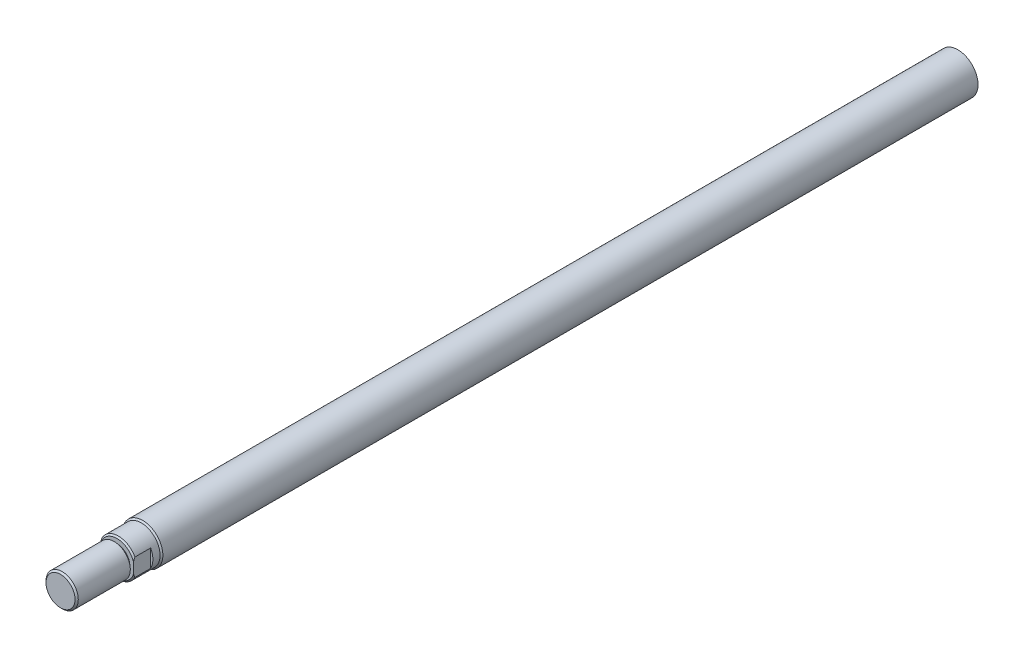
ISO-10303-21;
HEADER;
FILE_DESCRIPTION(('STEP AP214'),'2;1');
FILE_NAME('part.step','',(''),(''),'','','');
FILE_SCHEMA(('AUTOMOTIVE_DESIGN { 1 0 10303 214 1 1 1 1 }'));
ENDSEC;
DATA;
#1=APPLICATION_CONTEXT('core data for automotive mechanical design processes');
#2=APPLICATION_PROTOCOL_DEFINITION('international standard','automotive_design',2000,#1);
#3=PRODUCT_CONTEXT('',#1,'mechanical');
#4=PRODUCT('Part','Part','',(#3));
#5=PRODUCT_RELATED_PRODUCT_CATEGORY('part','',(#4));
#6=PRODUCT_DEFINITION_FORMATION('','',#4);
#7=PRODUCT_DEFINITION_CONTEXT('part definition',#1,'design');
#8=PRODUCT_DEFINITION('design','',#6,#7);
#9=PRODUCT_DEFINITION_SHAPE('','',#8);
#10=(LENGTH_UNIT() NAMED_UNIT(*) SI_UNIT(.MILLI.,.METRE.));
#11=(NAMED_UNIT(*) PLANE_ANGLE_UNIT() SI_UNIT($,.RADIAN.));
#12=(NAMED_UNIT(*) SI_UNIT($,.STERADIAN.) SOLID_ANGLE_UNIT());
#13=UNCERTAINTY_MEASURE_WITH_UNIT(LENGTH_MEASURE(1.E-05),#10,'distance_accuracy_value','');
#14=(GEOMETRIC_REPRESENTATION_CONTEXT(3) GLOBAL_UNCERTAINTY_ASSIGNED_CONTEXT((#13)) GLOBAL_UNIT_ASSIGNED_CONTEXT((#10,
#11,#12)) REPRESENTATION_CONTEXT('',''));
#15=CARTESIAN_POINT('',(0.,0.,0.));
#16=DIRECTION('',(0.,0.,1.));
#17=DIRECTION('',(1.,0.,0.));
#18=AXIS2_PLACEMENT_3D('',#15,#16,#17);
#19=CARTESIAN_POINT('',(0.,0.,16.3));
#20=DIRECTION('',(0.,0.,-1.));
#21=DIRECTION('',(-1.,0.,0.));
#22=AXIS2_PLACEMENT_3D('',#19,#20,#21);
#23=CONICAL_SURFACE('',#22,9.3,0.785398163397424);
#24=CARTESIAN_POINT('',(8.2,9.66938646409968,12.9217889829788));
#25=CARTESIAN_POINT('',(8.2,9.42998896150562,13.1043279332616));
#26=CARTESIAN_POINT('',(8.2,9.18925082407671,13.2851381900016));
#27=CARTESIAN_POINT('',(8.2,8.70453793453939,13.6424973615461));
#28=CARTESIAN_POINT('',(8.2,8.46056234686755,13.819045141731));
#29=CARTESIAN_POINT('',(8.2,7.96682637123515,14.1684776338376));
#30=CARTESIAN_POINT('',(8.2,7.71703424980347,14.3413176647774));
#31=CARTESIAN_POINT('',(8.2,7.21312298565451,14.6805490713805));
#32=CARTESIAN_POINT('',(8.2,6.95900416670312,14.8469409265334));
#33=CARTESIAN_POINT('',(8.2,6.42947671292095,15.1820586520401));
#34=CARTESIAN_POINT('',(8.2,6.15373827159313,15.3502662187331));
#35=CARTESIAN_POINT('',(8.2,5.5955497655709,15.6753497914216));
#36=CARTESIAN_POINT('',(8.2,5.31309849781905,15.8322237455684));
#37=CARTESIAN_POINT('',(8.2,4.74150496026828,16.1309612876175));
#38=CARTESIAN_POINT('',(8.2,4.45238826629966,16.2728733853582));
#39=CARTESIAN_POINT('',(8.2,3.86585505569199,16.5381850488038));
#40=CARTESIAN_POINT('',(8.2,3.56844287804944,16.661594084989));
#41=CARTESIAN_POINT('',(8.2,2.97954379579467,16.8795289509335));
#42=CARTESIAN_POINT('',(8.2,2.68847508231651,16.9751697153472));
#43=CARTESIAN_POINT('',(8.2,2.09889536787144,17.1403661216476));
#44=CARTESIAN_POINT('',(8.2,1.80038456917459,17.2099224716657));
#45=CARTESIAN_POINT('',(8.2,1.20406994705388,17.3171442848573));
#46=CARTESIAN_POINT('',(8.2,0.906383754375931,17.3554508204848));
#47=CARTESIAN_POINT('',(8.2,0.308599361296273,17.3996051557993));
#48=CARTESIAN_POINT('',(8.2,0.00850153186887214,17.4054578555395));
#49=CARTESIAN_POINT('',(8.2,-0.591231458672635,17.3841925609234));
#50=CARTESIAN_POINT('',(8.2,-0.890863686490328,17.3569937801791));
#51=CARTESIAN_POINT('',(8.2,-1.48566988710752,17.2717083902375));
#52=CARTESIAN_POINT('',(8.2,-1.78084275774996,17.2136142694729));
#53=CARTESIAN_POINT('',(8.2,-2.37070208146198,17.0690785130305));
#54=CARTESIAN_POINT('',(8.2,-2.6652445195716,16.9820599526893));
#55=CARTESIAN_POINT('',(8.2,-3.24639509628077,16.784997584622));
#56=CARTESIAN_POINT('',(8.2,-3.53300320904219,16.6749537019239));
#57=CARTESIAN_POINT('',(8.2,-4.08868065838188,16.4405228141886));
#58=CARTESIAN_POINT('',(8.2,-4.35801459110504,16.3167550735313));
#59=CARTESIAN_POINT('',(8.2,-4.88997313404525,16.0554655313575));
#60=CARTESIAN_POINT('',(8.2,-5.15259562501031,15.9179394511683));
#61=CARTESIAN_POINT('',(8.2,-5.67231767943956,15.6316471213539));
#62=CARTESIAN_POINT('',(8.2,-5.92940450076075,15.482857896668));
#63=CARTESIAN_POINT('',(8.2,-6.43822276614362,15.1764944940382));
#64=CARTESIAN_POINT('',(8.2,-6.6899548129336,15.0189213121147));
#65=CARTESIAN_POINT('',(8.2,-7.17436730586817,14.7059930250791));
#66=CARTESIAN_POINT('',(8.2,-7.4073070417649,14.5510375668562));
#67=CARTESIAN_POINT('',(8.2,-7.86963798897344,14.2359070977222));
#68=CARTESIAN_POINT('',(8.2,-8.0990290138282,14.0757318139143));
#69=CARTESIAN_POINT('',(8.2,-8.55345168120029,13.7519530887754));
#70=CARTESIAN_POINT('',(8.2,-8.77850045964103,13.5883736281135));
#71=CARTESIAN_POINT('',(8.2,-9.22587729874031,13.2576201644036));
#72=CARTESIAN_POINT('',(8.2,-9.44820586823233,13.0904468502536));
#73=CARTESIAN_POINT('',(8.2,-9.66938646409968,12.9217889829788));
#74=B_SPLINE_CURVE_WITH_KNOTS('',3,(#24,#25,#26,#27,#28,#29,#30,#31,#32,#33,#34,#35,#36,#37,#38,
#39,#40,#41,#42,#43,#44,#45,#46,#47,#48,#49,#50,#51,#52,#53,#54,#55,#56,#57,#58,#59,#60,#61,#62,
#63,#64,#65,#66,#67,#68,#69,#70,#71,#72,#73),.UNSPECIFIED.,.F.,.F.,(4,2,2,2,2,2,2,2,2,2,2,2,2,2,
2,2,2,2,2,2,2,2,2,2,4),(0.,0.903171316395402,1.8065804530234,2.71777523283702,3.62890212521683,
4.59767089342737,5.56661461129223,6.53231336518104,7.49751614259833,8.41565568227574,
9.33377029478543,10.2325398946054,11.1311737897005,12.0320086041224,12.9330625382225,
13.8532907884204,14.7735220349885,15.6622806210588,16.5513164643122,17.4422173814234,
18.3330174832005,19.1722500620807,20.0115265873367,20.8461418080354,21.6805984450706),.UNSPECIFIED.);
#75=CARTESIAN_POINT('',(8.2,4.38748219369605,16.3));
#76=VERTEX_POINT('',#75);
#77=CARTESIAN_POINT('',(8.2,2.59229627936318,17.));
#78=VERTEX_POINT('',#77);
#79=EDGE_CURVE('E117',#76,#78,#74,.T.);
#80=ORIENTED_EDGE('',*,*,#79,.F.);
#81=CARTESIAN_POINT('',(0.,0.,16.3));
#82=DIRECTION('',(0.,0.,-1.));
#83=DIRECTION('',(-1.,0.,0.));
#84=AXIS2_PLACEMENT_3D('',#81,#82,#83);
#85=CIRCLE('',#84,9.3);
#86=CARTESIAN_POINT('',(-8.2,4.38748219369605,16.3));
#87=VERTEX_POINT('',#86);
#88=EDGE_CURVE('E104',#87,#76,#85,.T.);
#89=ORIENTED_EDGE('',*,*,#88,.F.);
#90=CARTESIAN_POINT('',(-8.2,-9.66938646409968,12.9217889829788));
#91=CARTESIAN_POINT('',(-8.2,-9.42998896150562,13.1043279332616));
#92=CARTESIAN_POINT('',(-8.2,-9.18925082407671,13.2851381900016));
#93=CARTESIAN_POINT('',(-8.2,-8.70453793453939,13.6424973615461));
#94=CARTESIAN_POINT('',(-8.2,-8.46056234686755,13.819045141731));
#95=CARTESIAN_POINT('',(-8.2,-7.96682637123515,14.1684776338376));
#96=CARTESIAN_POINT('',(-8.2,-7.71703424980347,14.3413176647774));
#97=CARTESIAN_POINT('',(-8.2,-7.21312298565451,14.6805490713805));
#98=CARTESIAN_POINT('',(-8.2,-6.95900416670312,14.8469409265334));
#99=CARTESIAN_POINT('',(-8.2,-6.42947671292095,15.1820586520401));
#100=CARTESIAN_POINT('',(-8.2,-6.15373827159313,15.3502662187331));
#101=CARTESIAN_POINT('',(-8.2,-5.5955497655709,15.6753497914216));
#102=CARTESIAN_POINT('',(-8.2,-5.31309849781905,15.8322237455684));
#103=CARTESIAN_POINT('',(-8.2,-4.74150496026828,16.1309612876175));
#104=CARTESIAN_POINT('',(-8.2,-4.45238826629966,16.2728733853582));
#105=CARTESIAN_POINT('',(-8.2,-3.86585505569199,16.5381850488038));
#106=CARTESIAN_POINT('',(-8.2,-3.56844287804944,16.661594084989));
#107=CARTESIAN_POINT('',(-8.2,-2.97954379579467,16.8795289509335));
#108=CARTESIAN_POINT('',(-8.2,-2.68847508231651,16.9751697153472));
#109=CARTESIAN_POINT('',(-8.2,-2.09889536787144,17.1403661216476));
#110=CARTESIAN_POINT('',(-8.2,-1.80038456917459,17.2099224716657));
#111=CARTESIAN_POINT('',(-8.2,-1.20406994705388,17.3171442848573));
#112=CARTESIAN_POINT('',(-8.2,-0.906383754375931,17.3554508204848));
#113=CARTESIAN_POINT('',(-8.2,-0.308599361296273,17.3996051557993));
#114=CARTESIAN_POINT('',(-8.2,-0.00850153186887214,17.4054578555395));
#115=CARTESIAN_POINT('',(-8.2,0.591231458672635,17.3841925609234));
#116=CARTESIAN_POINT('',(-8.2,0.890863686490328,17.3569937801791));
#117=CARTESIAN_POINT('',(-8.2,1.48566988710752,17.2717083902375));
#118=CARTESIAN_POINT('',(-8.2,1.78084275774996,17.2136142694729));
#119=CARTESIAN_POINT('',(-8.2,2.37070208146198,17.0690785130305));
#120=CARTESIAN_POINT('',(-8.2,2.6652445195716,16.9820599526893));
#121=CARTESIAN_POINT('',(-8.2,3.24639509628077,16.784997584622));
#122=CARTESIAN_POINT('',(-8.2,3.53300320904219,16.6749537019239));
#123=CARTESIAN_POINT('',(-8.2,4.08868065838188,16.4405228141886));
#124=CARTESIAN_POINT('',(-8.2,4.35801459110504,16.3167550735313));
#125=CARTESIAN_POINT('',(-8.2,4.88997313404525,16.0554655313575));
#126=CARTESIAN_POINT('',(-8.2,5.15259562501031,15.9179394511683));
#127=CARTESIAN_POINT('',(-8.2,5.67231767943956,15.6316471213539));
#128=CARTESIAN_POINT('',(-8.2,5.92940450076075,15.482857896668));
#129=CARTESIAN_POINT('',(-8.2,6.43822276614362,15.1764944940382));
#130=CARTESIAN_POINT('',(-8.2,6.6899548129336,15.0189213121147));
#131=CARTESIAN_POINT('',(-8.2,7.17436730586817,14.7059930250791));
#132=CARTESIAN_POINT('',(-8.2,7.4073070417649,14.5510375668562));
#133=CARTESIAN_POINT('',(-8.2,7.86963798897344,14.2359070977222));
#134=CARTESIAN_POINT('',(-8.2,8.0990290138282,14.0757318139143));
#135=CARTESIAN_POINT('',(-8.2,8.55345168120029,13.7519530887754));
#136=CARTESIAN_POINT('',(-8.2,8.77850045964103,13.5883736281135));
#137=CARTESIAN_POINT('',(-8.2,9.22587729874031,13.2576201644036));
#138=CARTESIAN_POINT('',(-8.2,9.44820586823233,13.0904468502536));
#139=CARTESIAN_POINT('',(-8.2,9.66938646409968,12.9217889829788));
#140=B_SPLINE_CURVE_WITH_KNOTS('',3,(#90,#91,#92,#93,#94,#95,#96,#97,#98,#99,#100,#101,#102,
#103,#104,#105,#106,#107,#108,#109,#110,#111,#112,#113,#114,#115,#116,#117,#118,#119,#120,#121,
#122,#123,#124,#125,#126,#127,#128,#129,#130,#131,#132,#133,#134,#135,#136,#137,#138,#139),
.UNSPECIFIED.,.F.,.F.,(4,2,2,2,2,2,2,2,2,2,2,2,2,2,2,2,2,2,2,2,2,2,2,2,4),(0.,0.903171316395402,
1.8065804530234,2.71777523283702,3.62890212521683,4.59767089342737,5.56661461129223,
6.53231336518104,7.49751614259833,8.41565568227574,9.33377029478543,10.2325398946054,
11.1311737897005,12.0320086041224,12.9330625382225,13.8532907884204,14.7735220349885,
15.6622806210588,16.5513164643122,17.4422173814234,18.3330174832005,19.1722500620807,
20.0115265873367,20.8461418080354,21.6805984450706),.UNSPECIFIED.);
#141=CARTESIAN_POINT('',(-8.2,2.59229627936318,17.));
#142=VERTEX_POINT('',#141);
#143=EDGE_CURVE('E139',#142,#87,#140,.T.);
#144=ORIENTED_EDGE('',*,*,#143,.F.);
#145=CARTESIAN_POINT('',(0.,0.,17.));
#146=DIRECTION('',(0.,0.,-1.));
#147=DIRECTION('',(-1.,0.,0.));
#148=AXIS2_PLACEMENT_3D('',#145,#146,#147);
#149=CIRCLE('',#148,8.6);
#150=EDGE_CURVE('E162',#142,#78,#149,.T.);
#151=ORIENTED_EDGE('',*,*,#150,.T.);
#152=EDGE_LOOP('',(#80,#89,#144,#151));
#153=FACE_BOUND('',#152,.T.);
#154=ADVANCED_FACE('F35',(#153),#23,.T.);
#155=CARTESIAN_POINT('',(0.,0.,45.));
#156=DIRECTION('',(0.,0.,1.));
#157=DIRECTION('',(1.,0.,0.));
#158=AXIS2_PLACEMENT_3D('',#155,#156,#157);
#159=PLANE('',#158);
#160=CARTESIAN_POINT('',(0.,0.,45.));
#161=DIRECTION('',(0.,0.,1.));
#162=DIRECTION('',(1.,0.,0.));
#163=AXIS2_PLACEMENT_3D('',#160,#161,#162);
#164=CIRCLE('',#163,7.20000000000003);
#165=CARTESIAN_POINT('',(7.20000000000003,0.,45.));
#166=VERTEX_POINT('',#165);
#167=EDGE_CURVE('E11',#166,#166,#164,.T.);
#168=ORIENTED_EDGE('',*,*,#167,.T.);
#169=EDGE_LOOP('',(#168));
#170=FACE_BOUND('',#169,.T.);
#171=ADVANCED_FACE('F186',(#170),#159,.T.);
#172=CARTESIAN_POINT('',(0.,0.,-400.));
#173=DIRECTION('',(0.,0.,-1.));
#174=DIRECTION('',(-1.,0.,0.));
#175=AXIS2_PLACEMENT_3D('',#172,#173,#174);
#176=CYLINDRICAL_SURFACE('',#175,8.);
#177=CARTESIAN_POINT('',(0.,0.,44.2));
#178=DIRECTION('',(0.,0.,1.));
#179=DIRECTION('',(1.,0.,0.));
#180=AXIS2_PLACEMENT_3D('',#177,#178,#179);
#181=CIRCLE('',#180,8.);
#182=CARTESIAN_POINT('',(8.,0.,44.2));
#183=VERTEX_POINT('',#182);
#184=EDGE_CURVE('E43',#183,#183,#181,.F.);
#185=ORIENTED_EDGE('',*,*,#184,.T.);
#186=EDGE_LOOP('',(#185));
#187=FACE_BOUND('',#186,.T.);
#188=CARTESIAN_POINT('',(0.,0.,18.4));
#189=DIRECTION('',(0.,0.,-1.));
#190=DIRECTION('',(-1.,0.,0.));
#191=AXIS2_PLACEMENT_3D('',#188,#189,#190);
#192=CIRCLE('',#191,8.);
#193=CARTESIAN_POINT('',(-8.,0.,18.4));
#194=VERTEX_POINT('',#193);
#195=EDGE_CURVE('E171',#194,#194,#192,.T.);
#196=ORIENTED_EDGE('',*,*,#195,.F.);
#197=EDGE_LOOP('',(#196));
#198=FACE_BOUND('',#197,.T.);
#199=ADVANCED_FACE('F176',(#187,#198),#176,.T.);
#200=CARTESIAN_POINT('',(0.,-8.,18.4));
#201=DIRECTION('',(0.,0.,-1.));
#202=DIRECTION('',(-1.,0.,0.));
#203=AXIS2_PLACEMENT_3D('',#200,#201,#202);
#204=PLANE('',#203);
#205=ORIENTED_EDGE('',*,*,#195,.T.);
#206=EDGE_LOOP('',(#205));
#207=FACE_BOUND('',#206,.T.);
#208=CARTESIAN_POINT('',(0.,0.,18.4));
#209=DIRECTION('',(0.,0.,-1.));
#210=DIRECTION('',(-1.,0.,0.));
#211=AXIS2_PLACEMENT_3D('',#208,#209,#210);
#212=CIRCLE('',#211,6.4);
#213=CARTESIAN_POINT('',(-6.4,0.,18.4));
#214=VERTEX_POINT('',#213);
#215=EDGE_CURVE('E168',#214,#214,#212,.T.);
#216=ORIENTED_EDGE('',*,*,#215,.F.);
#217=EDGE_LOOP('',(#216));
#218=FACE_BOUND('',#217,.T.);
#219=ADVANCED_FACE('F220',(#207,#218),#204,.T.);
#220=CARTESIAN_POINT('',(0.,0.,-400.));
#221=DIRECTION('',(0.,0.,-1.));
#222=DIRECTION('',(-1.,0.,0.));
#223=AXIS2_PLACEMENT_3D('',#220,#221,#222);
#224=CYLINDRICAL_SURFACE('',#223,6.4);
#225=ORIENTED_EDGE('',*,*,#215,.T.);
#226=EDGE_LOOP('',(#225));
#227=FACE_BOUND('',#226,.T.);
#228=CARTESIAN_POINT('',(0.,0.,17.));
#229=DIRECTION('',(0.,0.,-1.));
#230=DIRECTION('',(-1.,0.,0.));
#231=AXIS2_PLACEMENT_3D('',#228,#229,#230);
#232=CIRCLE('',#231,6.4);
#233=CARTESIAN_POINT('',(-6.4,0.,17.));
#234=VERTEX_POINT('',#233);
#235=EDGE_CURVE('E165',#234,#234,#232,.T.);
#236=ORIENTED_EDGE('',*,*,#235,.F.);
#237=EDGE_LOOP('',(#236));
#238=FACE_BOUND('',#237,.T.);
#239=ADVANCED_FACE('F200',(#227,#238),#224,.T.);
#240=CARTESIAN_POINT('',(0.,-6.4,17.));
#241=DIRECTION('',(0.,0.,1.));
#242=DIRECTION('',(1.,0.,0.));
#243=AXIS2_PLACEMENT_3D('',#240,#241,#242);
#244=PLANE('',#243);
#245=DIRECTION('',(0.,-1.,0.));
#246=VECTOR('',#245,1.);
#247=CARTESIAN_POINT('',(8.2,4.38748219369605,17.));
#248=LINE('',#247,#246);
#249=CARTESIAN_POINT('',(8.2,-2.59229627936318,17.));
#250=VERTEX_POINT('',#249);
#251=EDGE_CURVE('E91',#78,#250,#248,.T.);
#252=ORIENTED_EDGE('',*,*,#251,.F.);
#253=ORIENTED_EDGE('',*,*,#150,.F.);
#254=DIRECTION('',(0.,1.,0.));
#255=VECTOR('',#254,1.);
#256=CARTESIAN_POINT('',(-8.2,4.38748219369605,17.));
#257=LINE('',#256,#255);
#258=CARTESIAN_POINT('',(-8.2,-2.59229627936318,17.));
#259=VERTEX_POINT('',#258);
#260=EDGE_CURVE('E211',#259,#142,#257,.T.);
#261=ORIENTED_EDGE('',*,*,#260,.F.);
#262=EDGE_CURVE('E161',#250,#259,#149,.T.);
#263=ORIENTED_EDGE('',*,*,#262,.F.);
#264=EDGE_LOOP('',(#252,#253,#261,#263));
#265=FACE_BOUND('',#264,.T.);
#266=ORIENTED_EDGE('',*,*,#235,.T.);
#267=EDGE_LOOP('',(#266));
#268=FACE_BOUND('',#267,.T.);
#269=ADVANCED_FACE('F193',(#265,#268),#244,.T.);
#270=CARTESIAN_POINT('',(8.2,-4.38748219369605,16.3));
#271=VERTEX_POINT('',#270);
#272=EDGE_CURVE('E106',#250,#271,#74,.T.);
#273=ORIENTED_EDGE('',*,*,#272,.F.);
#274=ORIENTED_EDGE('',*,*,#262,.T.);
#275=CARTESIAN_POINT('',(-8.2,-4.38748219369605,16.3));
#276=VERTEX_POINT('',#275);
#277=EDGE_CURVE('E146',#276,#259,#140,.T.);
#278=ORIENTED_EDGE('',*,*,#277,.F.);
#279=EDGE_CURVE('E159',#271,#276,#85,.T.);
#280=ORIENTED_EDGE('',*,*,#279,.F.);
#281=EDGE_LOOP('',(#273,#274,#278,#280));
#282=FACE_BOUND('',#281,.T.);
#283=ADVANCED_FACE('F120',(#282),#23,.T.);
#284=CARTESIAN_POINT('',(0.,0.,-400.));
#285=DIRECTION('',(0.,0.,-1.));
#286=DIRECTION('',(-1.,0.,0.));
#287=AXIS2_PLACEMENT_3D('',#284,#285,#286);
#288=CYLINDRICAL_SURFACE('',#287,9.3);
#289=DIRECTION('',(0.,0.,1.));
#290=VECTOR('',#289,1.);
#291=CARTESIAN_POINT('',(8.2,4.38748219369605,8.5));
#292=LINE('',#291,#290);
#293=CARTESIAN_POINT('',(8.2,4.38748219369605,8.5));
#294=VERTEX_POINT('',#293);
#295=EDGE_CURVE('E95',#294,#76,#292,.T.);
#296=ORIENTED_EDGE('',*,*,#295,.F.);
#297=CARTESIAN_POINT('',(0.,0.,8.5));
#298=DIRECTION('',(0.,0.,1.));
#299=DIRECTION('',(1.,0.,0.));
#300=AXIS2_PLACEMENT_3D('',#297,#298,#299);
#301=CIRCLE('',#300,9.3);
#302=CARTESIAN_POINT('',(8.2,-4.38748219369605,8.50000000000001));
#303=VERTEX_POINT('',#302);
#304=EDGE_CURVE('E86',#303,#294,#301,.T.);
#305=ORIENTED_EDGE('',*,*,#304,.F.);
#306=DIRECTION('',(0.,0.,1.));
#307=VECTOR('',#306,1.);
#308=CARTESIAN_POINT('',(8.2,-4.38748219369605,8.5));
#309=LINE('',#308,#307);
#310=EDGE_CURVE('E97',#303,#271,#309,.T.);
#311=ORIENTED_EDGE('',*,*,#310,.T.);
#312=ORIENTED_EDGE('',*,*,#279,.T.);
#313=DIRECTION('',(0.,0.,1.));
#314=VECTOR('',#313,1.);
#315=CARTESIAN_POINT('',(-8.2,-4.38748219369605,8.5));
#316=LINE('',#315,#314);
#317=CARTESIAN_POINT('',(-8.2,-4.38748219369605,8.5));
#318=VERTEX_POINT('',#317);
#319=EDGE_CURVE('E148',#318,#276,#316,.T.);
#320=ORIENTED_EDGE('',*,*,#319,.F.);
#321=CARTESIAN_POINT('',(0.,0.,8.5));
#322=DIRECTION('',(0.,0.,1.));
#323=DIRECTION('',(1.,0.,0.));
#324=AXIS2_PLACEMENT_3D('',#321,#322,#323);
#325=CIRCLE('',#324,9.3);
#326=CARTESIAN_POINT('',(-8.2,4.38748219369605,8.50000000000001));
#327=VERTEX_POINT('',#326);
#328=EDGE_CURVE('E118',#327,#318,#325,.T.);
#329=ORIENTED_EDGE('',*,*,#328,.F.);
#330=DIRECTION('',(0.,0.,1.));
#331=VECTOR('',#330,1.);
#332=CARTESIAN_POINT('',(-8.2,4.38748219369605,8.5));
#333=LINE('',#332,#331);
#334=EDGE_CURVE('E147',#327,#87,#333,.T.);
#335=ORIENTED_EDGE('',*,*,#334,.T.);
#336=ORIENTED_EDGE('',*,*,#88,.T.);
#337=EDGE_LOOP('',(#296,#305,#311,#312,#320,#329,#335,#336));
#338=FACE_BOUND('',#337,.T.);
#339=CARTESIAN_POINT('',(0.,0.,4.95000000000001));
#340=DIRECTION('',(0.,0.,-1.));
#341=DIRECTION('',(-1.,0.,0.));
#342=AXIS2_PLACEMENT_3D('',#339,#340,#341);
#343=CIRCLE('',#342,9.3);
#344=CARTESIAN_POINT('',(-9.3,0.,4.95000000000001));
#345=VERTEX_POINT('',#344);
#346=EDGE_CURVE('E156',#345,#345,#343,.T.);
#347=ORIENTED_EDGE('',*,*,#346,.F.);
#348=EDGE_LOOP('',(#347));
#349=FACE_BOUND('',#348,.T.);
#350=ADVANCED_FACE('F100',(#338,#349),#288,.T.);
#351=CARTESIAN_POINT('',(0.,0.,4.24999999999998));
#352=DIRECTION('',(0.,0.,-1.));
#353=DIRECTION('',(-1.,0.,0.));
#354=AXIS2_PLACEMENT_3D('',#351,#352,#353);
#355=CONICAL_SURFACE('',#354,10.,0.785398163397426);
#356=ORIENTED_EDGE('',*,*,#346,.T.);
#357=EDGE_LOOP('',(#356));
#358=FACE_BOUND('',#357,.T.);
#359=CARTESIAN_POINT('',(0.,0.,4.24999999999998));
#360=DIRECTION('',(0.,0.,-1.));
#361=DIRECTION('',(-1.,0.,0.));
#362=AXIS2_PLACEMENT_3D('',#359,#360,#361);
#363=CIRCLE('',#362,10.);
#364=CARTESIAN_POINT('',(-10.,0.,4.24999999999998));
#365=VERTEX_POINT('',#364);
#366=EDGE_CURVE('E153',#365,#365,#363,.T.);
#367=ORIENTED_EDGE('',*,*,#366,.F.);
#368=EDGE_LOOP('',(#367));
#369=FACE_BOUND('',#368,.T.);
#370=ADVANCED_FACE('F199',(#358,#369),#355,.T.);
#371=CARTESIAN_POINT('',(0.,0.,-400.));
#372=DIRECTION('',(0.,0.,-1.));
#373=DIRECTION('',(-1.,0.,0.));
#374=AXIS2_PLACEMENT_3D('',#371,#372,#373);
#375=CYLINDRICAL_SURFACE('',#374,10.);
#376=ORIENTED_EDGE('',*,*,#366,.T.);
#377=EDGE_LOOP('',(#376));
#378=FACE_BOUND('',#377,.T.);
#379=CARTESIAN_POINT('',(0.,0.,-400.));
#380=DIRECTION('',(0.,0.,-1.));
#381=DIRECTION('',(-1.,0.,0.));
#382=AXIS2_PLACEMENT_3D('',#379,#380,#381);
#383=CIRCLE('',#382,10.);
#384=CARTESIAN_POINT('',(-10.,0.,-400.));
#385=VERTEX_POINT('',#384);
#386=EDGE_CURVE('E150',#385,#385,#383,.T.);
#387=ORIENTED_EDGE('',*,*,#386,.F.);
#388=EDGE_LOOP('',(#387));
#389=FACE_BOUND('',#388,.T.);
#390=ADVANCED_FACE('F253',(#378,#389),#375,.T.);
#391=CARTESIAN_POINT('',(0.,-10.,-400.));
#392=DIRECTION('',(0.,0.,-1.));
#393=DIRECTION('',(-1.,0.,0.));
#394=AXIS2_PLACEMENT_3D('',#391,#392,#393);
#395=PLANE('',#394);
#396=ORIENTED_EDGE('',*,*,#386,.T.);
#397=EDGE_LOOP('',(#396));
#398=FACE_BOUND('',#397,.T.);
#399=ADVANCED_FACE('F135',(#398),#395,.T.);
#400=CARTESIAN_POINT('',(-8.2,4.38748219369605,8.5));
#401=DIRECTION('',(1.,0.,0.));
#402=DIRECTION('',(0.,0.,-1.));
#403=AXIS2_PLACEMENT_3D('',#400,#401,#402);
#404=PLANE('',#403);
#405=ORIENTED_EDGE('',*,*,#277,.T.);
#406=ORIENTED_EDGE('',*,*,#260,.T.);
#407=ORIENTED_EDGE('',*,*,#143,.T.);
#408=ORIENTED_EDGE('',*,*,#334,.F.);
#409=DIRECTION('',(0.,1.,0.));
#410=VECTOR('',#409,1.);
#411=CARTESIAN_POINT('',(-8.2,4.38748219369605,8.5));
#412=LINE('',#411,#410);
#413=EDGE_CURVE('E56',#318,#327,#412,.T.);
#414=ORIENTED_EDGE('',*,*,#413,.F.);
#415=ORIENTED_EDGE('',*,*,#319,.T.);
#416=EDGE_LOOP('',(#405,#406,#407,#408,#414,#415));
#417=FACE_BOUND('',#416,.T.);
#418=ADVANCED_FACE('F131',(#417),#404,.F.);
#419=CARTESIAN_POINT('',(0.,0.,8.5));
#420=DIRECTION('',(0.,0.,1.));
#421=DIRECTION('',(1.,0.,0.));
#422=AXIS2_PLACEMENT_3D('',#419,#420,#421);
#423=PLANE('',#422);
#424=ORIENTED_EDGE('',*,*,#328,.T.);
#425=ORIENTED_EDGE('',*,*,#413,.T.);
#426=EDGE_LOOP('',(#424,#425));
#427=FACE_BOUND('',#426,.T.);
#428=ADVANCED_FACE('F128',(#427),#423,.T.);
#429=CARTESIAN_POINT('',(8.2,4.38748219369605,8.5));
#430=DIRECTION('',(-1.,0.,0.));
#431=DIRECTION('',(0.,0.,1.));
#432=AXIS2_PLACEMENT_3D('',#429,#430,#431);
#433=PLANE('',#432);
#434=ORIENTED_EDGE('',*,*,#79,.T.);
#435=ORIENTED_EDGE('',*,*,#251,.T.);
#436=ORIENTED_EDGE('',*,*,#272,.T.);
#437=ORIENTED_EDGE('',*,*,#310,.F.);
#438=DIRECTION('',(0.,-1.,0.));
#439=VECTOR('',#438,1.);
#440=CARTESIAN_POINT('',(8.2,4.38748219369605,8.5));
#441=LINE('',#440,#439);
#442=EDGE_CURVE('E49',#294,#303,#441,.T.);
#443=ORIENTED_EDGE('',*,*,#442,.F.);
#444=ORIENTED_EDGE('',*,*,#295,.T.);
#445=EDGE_LOOP('',(#434,#435,#436,#437,#443,#444));
#446=FACE_BOUND('',#445,.T.);
#447=ADVANCED_FACE('F94',(#446),#433,.F.);
#448=CARTESIAN_POINT('',(0.,0.,8.5));
#449=DIRECTION('',(0.,0.,1.));
#450=DIRECTION('',(1.,0.,0.));
#451=AXIS2_PLACEMENT_3D('',#448,#449,#450);
#452=PLANE('',#451);
#453=ORIENTED_EDGE('',*,*,#304,.T.);
#454=ORIENTED_EDGE('',*,*,#442,.T.);
#455=EDGE_LOOP('',(#453,#454));
#456=FACE_BOUND('',#455,.T.);
#457=ADVANCED_FACE('F87',(#456),#452,.T.);
#458=CARTESIAN_POINT('',(0.,0.,44.2));
#459=DIRECTION('',(0.,0.,-1.));
#460=DIRECTION('',(-1.,0.,0.));
#461=AXIS2_PLACEMENT_3D('',#458,#459,#460);
#462=CONICAL_SURFACE('',#461,8.,0.785398163397444);
#463=ORIENTED_EDGE('',*,*,#167,.F.);
#464=EDGE_LOOP('',(#463));
#465=FACE_BOUND('',#464,.T.);
#466=ORIENTED_EDGE('',*,*,#184,.F.);
#467=EDGE_LOOP('',(#466));
#468=FACE_BOUND('',#467,.T.);
#469=ADVANCED_FACE('F37',(#465,#468),#462,.T.);
#470=CLOSED_SHELL('',(#154,#171,#199,#219,#239,#269,#283,#350,#370,#390,#399,#418,#428,#447,
#457,#469));
#471=MANIFOLD_SOLID_BREP('B2',#470);
#472=ADVANCED_BREP_SHAPE_REPRESENTATION('',(#18,#471),#14);
#473=SHAPE_DEFINITION_REPRESENTATION(#9,#472);
ENDSEC;
END-ISO-10303-21;
